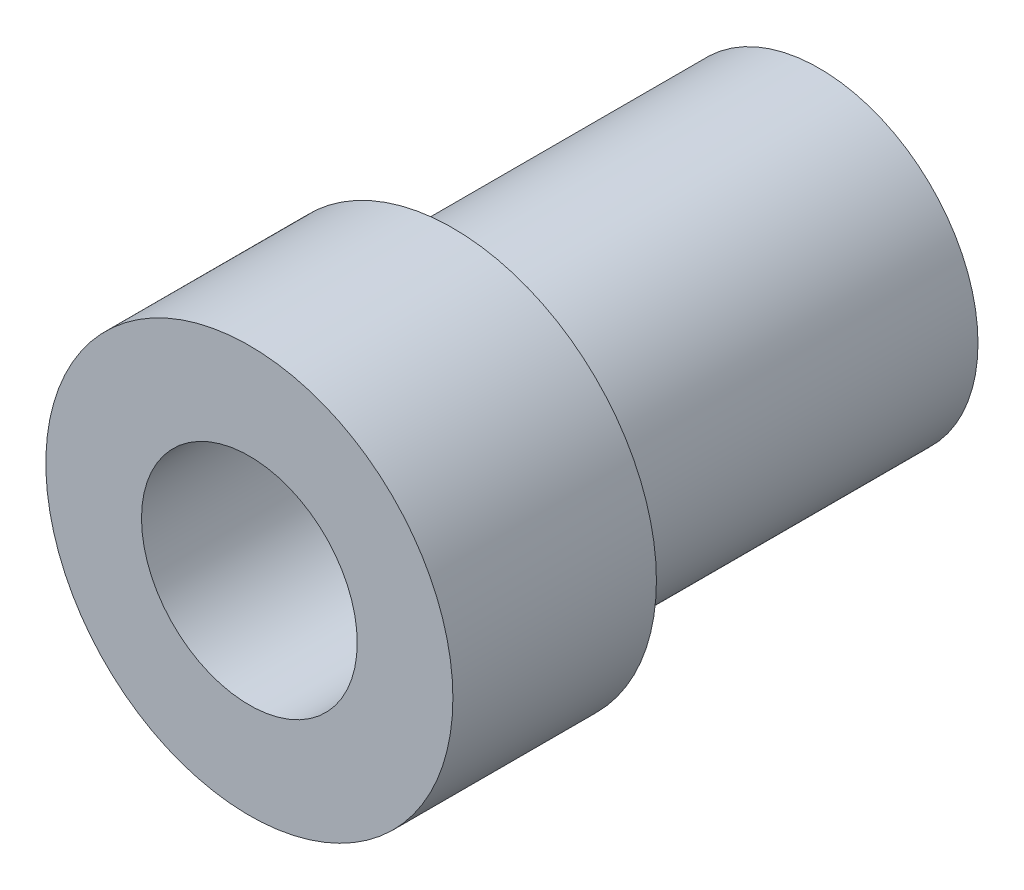
ISO-10303-21;
HEADER;
FILE_DESCRIPTION(('STEP AP214'),'2;1');
FILE_NAME('part.step','',(''),(''),'','','');
FILE_SCHEMA(('AUTOMOTIVE_DESIGN { 1 0 10303 214 1 1 1 1 }'));
ENDSEC;
DATA;
#1=APPLICATION_CONTEXT('core data for automotive mechanical design processes');
#2=APPLICATION_PROTOCOL_DEFINITION('international standard','automotive_design',2000,#1);
#3=PRODUCT_CONTEXT('',#1,'mechanical');
#4=PRODUCT('Part','Part','',(#3));
#5=PRODUCT_RELATED_PRODUCT_CATEGORY('part','',(#4));
#6=PRODUCT_DEFINITION_FORMATION('','',#4);
#7=PRODUCT_DEFINITION_CONTEXT('part definition',#1,'design');
#8=PRODUCT_DEFINITION('design','',#6,#7);
#9=PRODUCT_DEFINITION_SHAPE('','',#8);
#10=(LENGTH_UNIT() NAMED_UNIT(*) SI_UNIT(.MILLI.,.METRE.));
#11=(NAMED_UNIT(*) PLANE_ANGLE_UNIT() SI_UNIT($,.RADIAN.));
#12=(NAMED_UNIT(*) SI_UNIT($,.STERADIAN.) SOLID_ANGLE_UNIT());
#13=UNCERTAINTY_MEASURE_WITH_UNIT(LENGTH_MEASURE(1.E-05),#10,'distance_accuracy_value','');
#14=(GEOMETRIC_REPRESENTATION_CONTEXT(3) GLOBAL_UNCERTAINTY_ASSIGNED_CONTEXT((#13)) GLOBAL_UNIT_ASSIGNED_CONTEXT((#10,
#11,#12)) REPRESENTATION_CONTEXT('',''));
#15=CARTESIAN_POINT('',(0.,0.,0.));
#16=DIRECTION('',(0.,0.,1.));
#17=DIRECTION('',(1.,0.,0.));
#18=AXIS2_PLACEMENT_3D('',#15,#16,#17);
#19=CARTESIAN_POINT('',(0.,0.,9.));
#20=DIRECTION('',(0.,0.,-1.));
#21=DIRECTION('',(-1.,0.,0.));
#22=AXIS2_PLACEMENT_3D('',#19,#20,#21);
#23=CYLINDRICAL_SURFACE('',#22,3.9);
#24=CARTESIAN_POINT('',(0.,0.,0.));
#25=DIRECTION('',(0.,0.,1.));
#26=DIRECTION('',(1.,0.,0.));
#27=AXIS2_PLACEMENT_3D('',#24,#25,#26);
#28=CIRCLE('',#27,3.9);
#29=CARTESIAN_POINT('',(3.9,0.,0.));
#30=VERTEX_POINT('',#29);
#31=EDGE_CURVE('E36',#30,#30,#28,.T.);
#32=ORIENTED_EDGE('',*,*,#31,.T.);
#33=EDGE_LOOP('',(#32));
#34=FACE_BOUND('',#33,.T.);
#35=CARTESIAN_POINT('',(0.,0.,9.));
#36=DIRECTION('',(0.,0.,1.));
#37=DIRECTION('',(1.,0.,0.));
#38=AXIS2_PLACEMENT_3D('',#35,#36,#37);
#39=CIRCLE('',#38,3.9);
#40=CARTESIAN_POINT('',(3.9,0.,9.));
#41=VERTEX_POINT('',#40);
#42=EDGE_CURVE('E10',#41,#41,#39,.T.);
#43=ORIENTED_EDGE('',*,*,#42,.F.);
#44=EDGE_LOOP('',(#43));
#45=FACE_BOUND('',#44,.T.);
#46=ADVANCED_FACE('F30',(#34,#45),#23,.T.);
#47=CARTESIAN_POINT('',(0.,0.,0.));
#48=DIRECTION('',(0.,0.,1.));
#49=DIRECTION('',(1.,0.,0.));
#50=AXIS2_PLACEMENT_3D('',#47,#48,#49);
#51=PLANE('',#50);
#52=ORIENTED_EDGE('',*,*,#31,.F.);
#53=EDGE_LOOP('',(#52));
#54=FACE_BOUND('',#53,.T.);
#55=CARTESIAN_POINT('',(0.,0.,0.));
#56=DIRECTION('',(0.,0.,1.));
#57=DIRECTION('',(1.,0.,0.));
#58=AXIS2_PLACEMENT_3D('',#55,#56,#57);
#59=CIRCLE('',#58,2.65);
#60=CARTESIAN_POINT('',(2.65,0.,0.));
#61=VERTEX_POINT('',#60);
#62=EDGE_CURVE('E40',#61,#61,#59,.T.);
#63=ORIENTED_EDGE('',*,*,#62,.T.);
#64=EDGE_LOOP('',(#63));
#65=FACE_BOUND('',#64,.T.);
#66=ADVANCED_FACE('F74',(#54,#65),#51,.F.);
#67=CARTESIAN_POINT('',(0.,0.,9.));
#68=DIRECTION('',(0.,0.,-1.));
#69=DIRECTION('',(-1.,0.,0.));
#70=AXIS2_PLACEMENT_3D('',#67,#68,#69);
#71=CYLINDRICAL_SURFACE('',#70,2.65);
#72=ORIENTED_EDGE('',*,*,#62,.F.);
#73=EDGE_LOOP('',(#72));
#74=FACE_BOUND('',#73,.T.);
#75=CARTESIAN_POINT('',(0.,0.,14.));
#76=DIRECTION('',(0.,0.,1.));
#77=DIRECTION('',(1.,0.,0.));
#78=AXIS2_PLACEMENT_3D('',#75,#76,#77);
#79=CIRCLE('',#78,2.65);
#80=CARTESIAN_POINT('',(2.65,0.,14.));
#81=VERTEX_POINT('',#80);
#82=EDGE_CURVE('E44',#81,#81,#79,.T.);
#83=ORIENTED_EDGE('',*,*,#82,.T.);
#84=EDGE_LOOP('',(#83));
#85=FACE_BOUND('',#84,.T.);
#86=ADVANCED_FACE('F70',(#74,#85),#71,.F.);
#87=CARTESIAN_POINT('',(0.,0.,14.));
#88=DIRECTION('',(0.,0.,1.));
#89=DIRECTION('',(1.,0.,0.));
#90=AXIS2_PLACEMENT_3D('',#87,#88,#89);
#91=PLANE('',#90);
#92=ORIENTED_EDGE('',*,*,#82,.F.);
#93=EDGE_LOOP('',(#92));
#94=FACE_BOUND('',#93,.T.);
#95=CARTESIAN_POINT('',(0.,0.,14.));
#96=DIRECTION('',(0.,0.,1.));
#97=DIRECTION('',(1.,0.,0.));
#98=AXIS2_PLACEMENT_3D('',#95,#96,#97);
#99=CIRCLE('',#98,5.);
#100=CARTESIAN_POINT('',(5.,0.,14.));
#101=VERTEX_POINT('',#100);
#102=EDGE_CURVE('E49',#101,#101,#99,.T.);
#103=ORIENTED_EDGE('',*,*,#102,.T.);
#104=EDGE_LOOP('',(#103));
#105=FACE_BOUND('',#104,.T.);
#106=ADVANCED_FACE('F56',(#94,#105),#91,.T.);
#107=CARTESIAN_POINT('',(0.,0.,9.));
#108=DIRECTION('',(0.,0.,1.));
#109=DIRECTION('',(1.,0.,0.));
#110=AXIS2_PLACEMENT_3D('',#107,#108,#109);
#111=PLANE('',#110);
#112=CARTESIAN_POINT('',(0.,0.,9.));
#113=DIRECTION('',(0.,0.,1.));
#114=DIRECTION('',(1.,0.,0.));
#115=AXIS2_PLACEMENT_3D('',#112,#113,#114);
#116=CIRCLE('',#115,5.);
#117=CARTESIAN_POINT('',(5.,0.,9.));
#118=VERTEX_POINT('',#117);
#119=EDGE_CURVE('E50',#118,#118,#116,.T.);
#120=ORIENTED_EDGE('',*,*,#119,.F.);
#121=EDGE_LOOP('',(#120));
#122=FACE_BOUND('',#121,.T.);
#123=ORIENTED_EDGE('',*,*,#42,.T.);
#124=EDGE_LOOP('',(#123));
#125=FACE_BOUND('',#124,.T.);
#126=ADVANCED_FACE('F61',(#122,#125),#111,.F.);
#127=CARTESIAN_POINT('',(0.,0.,14.));
#128=DIRECTION('',(0.,0.,-1.));
#129=DIRECTION('',(-1.,0.,0.));
#130=AXIS2_PLACEMENT_3D('',#127,#128,#129);
#131=CYLINDRICAL_SURFACE('',#130,5.);
#132=ORIENTED_EDGE('',*,*,#102,.F.);
#133=EDGE_LOOP('',(#132));
#134=FACE_BOUND('',#133,.T.);
#135=ORIENTED_EDGE('',*,*,#119,.T.);
#136=EDGE_LOOP('',(#135));
#137=FACE_BOUND('',#136,.T.);
#138=ADVANCED_FACE('F58',(#134,#137),#131,.T.);
#139=CLOSED_SHELL('',(#46,#66,#86,#106,#126,#138));
#140=MANIFOLD_SOLID_BREP('B2',#139);
#141=ADVANCED_BREP_SHAPE_REPRESENTATION('',(#18,#140),#14);
#142=SHAPE_DEFINITION_REPRESENTATION(#9,#141);
ENDSEC;
END-ISO-10303-21;
